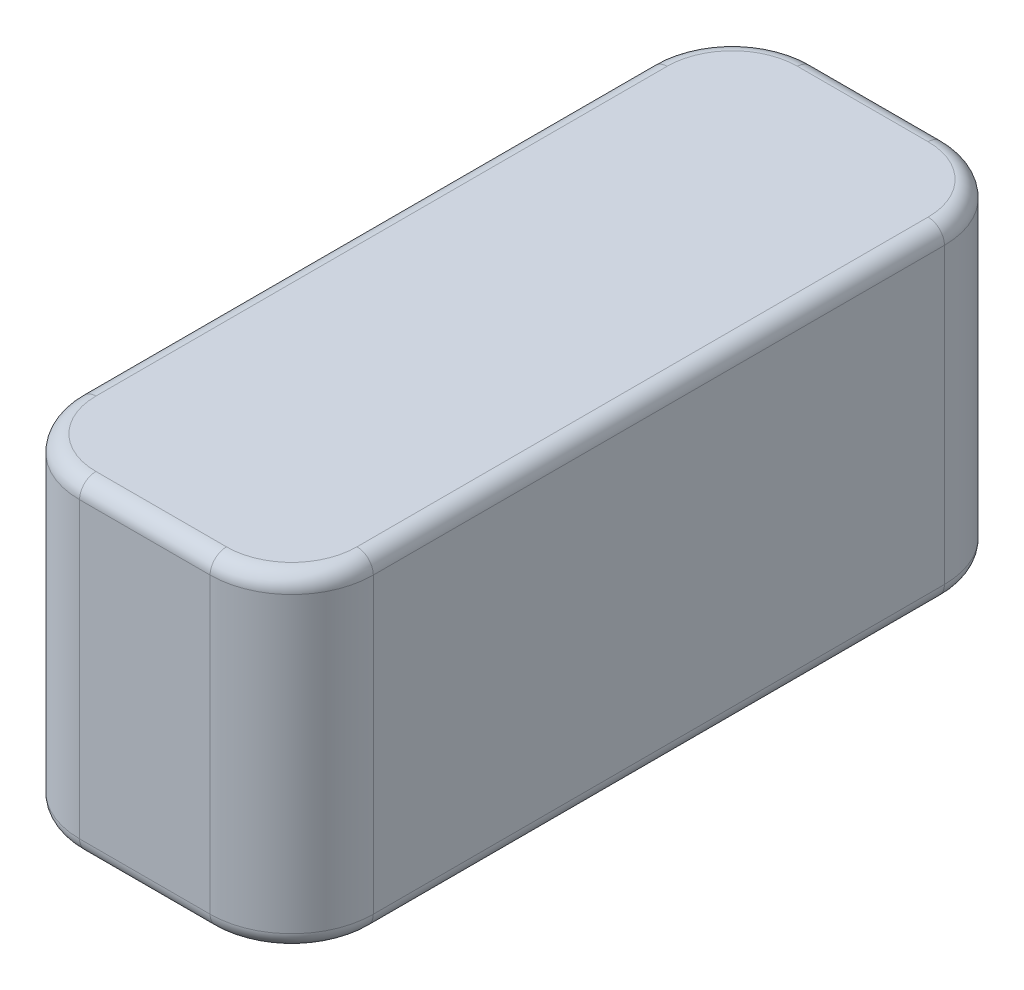
ISO-10303-21;
HEADER;
FILE_DESCRIPTION(('STEP AP214'),'2;1');
FILE_NAME('part.step','',(''),(''),'','','');
FILE_SCHEMA(('AUTOMOTIVE_DESIGN { 1 0 10303 214 1 1 1 1 }'));
ENDSEC;
DATA;
#1=APPLICATION_CONTEXT('core data for automotive mechanical design processes');
#2=APPLICATION_PROTOCOL_DEFINITION('international standard','automotive_design',2000,#1);
#3=PRODUCT_CONTEXT('',#1,'mechanical');
#4=PRODUCT('Part','Part','',(#3));
#5=PRODUCT_RELATED_PRODUCT_CATEGORY('part','',(#4));
#6=PRODUCT_DEFINITION_FORMATION('','',#4);
#7=PRODUCT_DEFINITION_CONTEXT('part definition',#1,'design');
#8=PRODUCT_DEFINITION('design','',#6,#7);
#9=PRODUCT_DEFINITION_SHAPE('','',#8);
#10=(LENGTH_UNIT() NAMED_UNIT(*) SI_UNIT(.MILLI.,.METRE.));
#11=(NAMED_UNIT(*) PLANE_ANGLE_UNIT() SI_UNIT($,.RADIAN.));
#12=(NAMED_UNIT(*) SI_UNIT($,.STERADIAN.) SOLID_ANGLE_UNIT());
#13=UNCERTAINTY_MEASURE_WITH_UNIT(LENGTH_MEASURE(1.E-05),#10,'distance_accuracy_value','');
#14=(GEOMETRIC_REPRESENTATION_CONTEXT(3) GLOBAL_UNCERTAINTY_ASSIGNED_CONTEXT((#13)) GLOBAL_UNIT_ASSIGNED_CONTEXT((#10,
#11,#12)) REPRESENTATION_CONTEXT('',''));
#15=CARTESIAN_POINT('',(0.,0.,0.));
#16=DIRECTION('',(0.,0.,1.));
#17=DIRECTION('',(1.,0.,0.));
#18=AXIS2_PLACEMENT_3D('',#15,#16,#17);
#19=CARTESIAN_POINT('',(-9.,20.,22.5));
#20=DIRECTION('',(1.,0.,0.));
#21=DIRECTION('',(0.,0.,-1.));
#22=AXIS2_PLACEMENT_3D('',#19,#20,#21);
#23=PLANE('',#22);
#24=DIRECTION('',(0.,-1.,0.));
#25=VECTOR('',#24,1.);
#26=CARTESIAN_POINT('',(-9.,20.,-17.5));
#27=LINE('',#26,#25);
#28=CARTESIAN_POINT('',(-9.,19.,-17.5));
#29=VERTEX_POINT('',#28);
#30=CARTESIAN_POINT('',(-9.,1.,-17.5));
#31=VERTEX_POINT('',#30);
#32=EDGE_CURVE('E298',#29,#31,#27,.T.);
#33=ORIENTED_EDGE('',*,*,#32,.T.);
#34=DIRECTION('',(0.,0.,1.));
#35=VECTOR('',#34,1.);
#36=CARTESIAN_POINT('',(-9.,1.,22.5));
#37=LINE('',#36,#35);
#38=CARTESIAN_POINT('',(-9.,1.,17.5));
#39=VERTEX_POINT('',#38);
#40=EDGE_CURVE('E198',#31,#39,#37,.T.);
#41=ORIENTED_EDGE('',*,*,#40,.T.);
#42=DIRECTION('',(0.,-1.,0.));
#43=VECTOR('',#42,1.);
#44=CARTESIAN_POINT('',(-9.,20.,17.5));
#45=LINE('',#44,#43);
#46=CARTESIAN_POINT('',(-9.,19.,17.5));
#47=VERTEX_POINT('',#46);
#48=EDGE_CURVE('E301',#39,#47,#45,.F.);
#49=ORIENTED_EDGE('',*,*,#48,.T.);
#50=DIRECTION('',(0.,0.,1.));
#51=VECTOR('',#50,1.);
#52=CARTESIAN_POINT('',(-9.,19.,-17.5));
#53=LINE('',#52,#51);
#54=EDGE_CURVE('E196',#47,#29,#53,.F.);
#55=ORIENTED_EDGE('',*,*,#54,.T.);
#56=EDGE_LOOP('',(#33,#41,#49,#55));
#57=FACE_BOUND('',#56,.T.);
#58=ADVANCED_FACE('F41',(#57),#23,.F.);
#59=CARTESIAN_POINT('',(9.,20.,22.5));
#60=DIRECTION('',(0.,0.,-1.));
#61=DIRECTION('',(-1.,0.,0.));
#62=AXIS2_PLACEMENT_3D('',#59,#60,#61);
#63=PLANE('',#62);
#64=DIRECTION('',(0.,-1.,0.));
#65=VECTOR('',#64,1.);
#66=CARTESIAN_POINT('',(-4.,20.,22.5));
#67=LINE('',#66,#65);
#68=CARTESIAN_POINT('',(-4.,19.,22.5));
#69=VERTEX_POINT('',#68);
#70=CARTESIAN_POINT('',(-4.,1.,22.5));
#71=VERTEX_POINT('',#70);
#72=EDGE_CURVE('E290',#69,#71,#67,.T.);
#73=ORIENTED_EDGE('',*,*,#72,.T.);
#74=DIRECTION('',(1.,0.,0.));
#75=VECTOR('',#74,1.);
#76=CARTESIAN_POINT('',(9.,1.,22.5));
#77=LINE('',#76,#75);
#78=CARTESIAN_POINT('',(4.,1.,22.5));
#79=VERTEX_POINT('',#78);
#80=EDGE_CURVE('E207',#71,#79,#77,.T.);
#81=ORIENTED_EDGE('',*,*,#80,.T.);
#82=DIRECTION('',(0.,-1.,0.));
#83=VECTOR('',#82,1.);
#84=CARTESIAN_POINT('',(4.,20.,22.5));
#85=LINE('',#84,#83);
#86=CARTESIAN_POINT('',(4.,19.,22.5));
#87=VERTEX_POINT('',#86);
#88=EDGE_CURVE('E295',#79,#87,#85,.F.);
#89=ORIENTED_EDGE('',*,*,#88,.T.);
#90=DIRECTION('',(1.,0.,0.));
#91=VECTOR('',#90,1.);
#92=CARTESIAN_POINT('',(-4.,19.,22.5));
#93=LINE('',#92,#91);
#94=EDGE_CURVE('E205',#87,#69,#93,.F.);
#95=ORIENTED_EDGE('',*,*,#94,.T.);
#96=EDGE_LOOP('',(#73,#81,#89,#95));
#97=FACE_BOUND('',#96,.T.);
#98=ADVANCED_FACE('F354',(#97),#63,.F.);
#99=CARTESIAN_POINT('',(9.,20.,22.5));
#100=DIRECTION('',(-1.,0.,0.));
#101=DIRECTION('',(0.,0.,1.));
#102=AXIS2_PLACEMENT_3D('',#99,#100,#101);
#103=PLANE('',#102);
#104=DIRECTION('',(0.,-1.,0.));
#105=VECTOR('',#104,1.);
#106=CARTESIAN_POINT('',(9.,20.,17.5));
#107=LINE('',#106,#105);
#108=CARTESIAN_POINT('',(9.,19.,17.5));
#109=VERTEX_POINT('',#108);
#110=CARTESIAN_POINT('',(9.,1.,17.5));
#111=VERTEX_POINT('',#110);
#112=EDGE_CURVE('E288',#109,#111,#107,.T.);
#113=ORIENTED_EDGE('',*,*,#112,.T.);
#114=DIRECTION('',(0.,0.,-1.));
#115=VECTOR('',#114,1.);
#116=CARTESIAN_POINT('',(9.,1.,22.5));
#117=LINE('',#116,#115);
#118=CARTESIAN_POINT('',(9.,1.,-17.5));
#119=VERTEX_POINT('',#118);
#120=EDGE_CURVE('E215',#111,#119,#117,.T.);
#121=ORIENTED_EDGE('',*,*,#120,.T.);
#122=DIRECTION('',(0.,-1.,0.));
#123=VECTOR('',#122,1.);
#124=CARTESIAN_POINT('',(9.,20.,-17.5));
#125=LINE('',#124,#123);
#126=CARTESIAN_POINT('',(9.,19.,-17.5));
#127=VERTEX_POINT('',#126);
#128=EDGE_CURVE('E246',#119,#127,#125,.F.);
#129=ORIENTED_EDGE('',*,*,#128,.T.);
#130=DIRECTION('',(0.,0.,-1.));
#131=VECTOR('',#130,1.);
#132=CARTESIAN_POINT('',(9.,19.,17.5));
#133=LINE('',#132,#131);
#134=EDGE_CURVE('E213',#127,#109,#133,.F.);
#135=ORIENTED_EDGE('',*,*,#134,.T.);
#136=EDGE_LOOP('',(#113,#121,#129,#135));
#137=FACE_BOUND('',#136,.T.);
#138=ADVANCED_FACE('F286',(#137),#103,.F.);
#139=CARTESIAN_POINT('',(9.,20.,-22.5));
#140=DIRECTION('',(0.,0.,1.));
#141=DIRECTION('',(1.,0.,0.));
#142=AXIS2_PLACEMENT_3D('',#139,#140,#141);
#143=PLANE('',#142);
#144=DIRECTION('',(0.,-1.,0.));
#145=VECTOR('',#144,1.);
#146=CARTESIAN_POINT('',(4.,20.,-22.5));
#147=LINE('',#146,#145);
#148=CARTESIAN_POINT('',(4.,19.,-22.5));
#149=VERTEX_POINT('',#148);
#150=CARTESIAN_POINT('',(4.,1.,-22.5));
#151=VERTEX_POINT('',#150);
#152=EDGE_CURVE('E174',#149,#151,#147,.T.);
#153=ORIENTED_EDGE('',*,*,#152,.T.);
#154=DIRECTION('',(-1.,0.,0.));
#155=VECTOR('',#154,1.);
#156=CARTESIAN_POINT('',(9.,1.,-22.5));
#157=LINE('',#156,#155);
#158=CARTESIAN_POINT('',(-4.,1.,-22.5));
#159=VERTEX_POINT('',#158);
#160=EDGE_CURVE('E190',#151,#159,#157,.T.);
#161=ORIENTED_EDGE('',*,*,#160,.T.);
#162=DIRECTION('',(0.,-1.,0.));
#163=VECTOR('',#162,1.);
#164=CARTESIAN_POINT('',(-4.,20.,-22.5));
#165=LINE('',#164,#163);
#166=CARTESIAN_POINT('',(-4.,19.,-22.5));
#167=VERTEX_POINT('',#166);
#168=EDGE_CURVE('E304',#159,#167,#165,.F.);
#169=ORIENTED_EDGE('',*,*,#168,.T.);
#170=DIRECTION('',(-1.,0.,0.));
#171=VECTOR('',#170,1.);
#172=CARTESIAN_POINT('',(4.,19.,-22.5));
#173=LINE('',#172,#171);
#174=EDGE_CURVE('E188',#167,#149,#173,.F.);
#175=ORIENTED_EDGE('',*,*,#174,.T.);
#176=EDGE_LOOP('',(#153,#161,#169,#175));
#177=FACE_BOUND('',#176,.T.);
#178=ADVANCED_FACE('F326',(#177),#143,.F.);
#179=CARTESIAN_POINT('',(0.,20.,0.));
#180=DIRECTION('',(0.,1.,0.));
#181=DIRECTION('',(0.,0.,1.));
#182=AXIS2_PLACEMENT_3D('',#179,#180,#181);
#183=PLANE('',#182);
#184=DIRECTION('',(0.,0.,1.));
#185=VECTOR('',#184,1.);
#186=CARTESIAN_POINT('',(-8.,20.,17.5));
#187=LINE('',#186,#185);
#188=CARTESIAN_POINT('',(-8.,20.,-17.5));
#189=VERTEX_POINT('',#188);
#190=CARTESIAN_POINT('',(-8.,20.,17.5));
#191=VERTEX_POINT('',#190);
#192=EDGE_CURVE('E50',#189,#191,#187,.T.);
#193=ORIENTED_EDGE('',*,*,#192,.T.);
#194=CARTESIAN_POINT('',(-4.,20.,17.5));
#195=DIRECTION('',(0.,1.,0.));
#196=DIRECTION('',(0.,0.,1.));
#197=AXIS2_PLACEMENT_3D('',#194,#195,#196);
#198=CIRCLE('',#197,4.);
#199=CARTESIAN_POINT('',(-4.,20.,21.5));
#200=VERTEX_POINT('',#199);
#201=EDGE_CURVE('E11',#191,#200,#198,.T.);
#202=ORIENTED_EDGE('',*,*,#201,.T.);
#203=DIRECTION('',(1.,0.,0.));
#204=VECTOR('',#203,1.);
#205=CARTESIAN_POINT('',(4.,20.,21.5));
#206=LINE('',#205,#204);
#207=CARTESIAN_POINT('',(4.,20.,21.5));
#208=VERTEX_POINT('',#207);
#209=EDGE_CURVE('E217',#200,#208,#206,.T.);
#210=ORIENTED_EDGE('',*,*,#209,.T.);
#211=CARTESIAN_POINT('',(4.,20.,17.5));
#212=DIRECTION('',(0.,1.,0.));
#213=DIRECTION('',(0.,0.,1.));
#214=AXIS2_PLACEMENT_3D('',#211,#212,#213);
#215=CIRCLE('',#214,4.);
#216=CARTESIAN_POINT('',(8.,20.,17.5));
#217=VERTEX_POINT('',#216);
#218=EDGE_CURVE('E219',#208,#217,#215,.T.);
#219=ORIENTED_EDGE('',*,*,#218,.T.);
#220=DIRECTION('',(0.,0.,-1.));
#221=VECTOR('',#220,1.);
#222=CARTESIAN_POINT('',(8.,20.,-17.5));
#223=LINE('',#222,#221);
#224=CARTESIAN_POINT('',(8.,20.,-17.5));
#225=VERTEX_POINT('',#224);
#226=EDGE_CURVE('E221',#217,#225,#223,.T.);
#227=ORIENTED_EDGE('',*,*,#226,.T.);
#228=CARTESIAN_POINT('',(4.,20.,-17.5));
#229=DIRECTION('',(0.,1.,0.));
#230=DIRECTION('',(0.,0.,1.));
#231=AXIS2_PLACEMENT_3D('',#228,#229,#230);
#232=CIRCLE('',#231,4.);
#233=CARTESIAN_POINT('',(4.,20.,-21.5));
#234=VERTEX_POINT('',#233);
#235=EDGE_CURVE('E223',#225,#234,#232,.T.);
#236=ORIENTED_EDGE('',*,*,#235,.T.);
#237=DIRECTION('',(-1.,0.,0.));
#238=VECTOR('',#237,1.);
#239=CARTESIAN_POINT('',(-4.,20.,-21.5));
#240=LINE('',#239,#238);
#241=CARTESIAN_POINT('',(-4.,20.,-21.5));
#242=VERTEX_POINT('',#241);
#243=EDGE_CURVE('E225',#234,#242,#240,.T.);
#244=ORIENTED_EDGE('',*,*,#243,.T.);
#245=CARTESIAN_POINT('',(-4.,20.,-17.5));
#246=DIRECTION('',(0.,1.,0.));
#247=DIRECTION('',(0.,0.,1.));
#248=AXIS2_PLACEMENT_3D('',#245,#246,#247);
#249=CIRCLE('',#248,4.);
#250=EDGE_CURVE('E61',#242,#189,#249,.T.);
#251=ORIENTED_EDGE('',*,*,#250,.T.);
#252=EDGE_LOOP('',(#193,#202,#210,#219,#227,#236,#244,#251));
#253=FACE_BOUND('',#252,.T.);
#254=ADVANCED_FACE('F342',(#253),#183,.T.);
#255=CARTESIAN_POINT('',(0.,0.,0.));
#256=DIRECTION('',(0.,1.,0.));
#257=DIRECTION('',(0.,0.,1.));
#258=AXIS2_PLACEMENT_3D('',#255,#256,#257);
#259=PLANE('',#258);
#260=DIRECTION('',(-1.,0.,0.));
#261=VECTOR('',#260,1.);
#262=CARTESIAN_POINT('',(0.,0.,-21.5));
#263=LINE('',#262,#261);
#264=CARTESIAN_POINT('',(-4.,0.,-21.5));
#265=VERTEX_POINT('',#264);
#266=CARTESIAN_POINT('',(4.,0.,-21.5));
#267=VERTEX_POINT('',#266);
#268=EDGE_CURVE('E178',#265,#267,#263,.F.);
#269=ORIENTED_EDGE('',*,*,#268,.T.);
#270=CARTESIAN_POINT('',(4.,0.,-17.5));
#271=DIRECTION('',(0.,1.,0.));
#272=DIRECTION('',(0.,0.,1.));
#273=AXIS2_PLACEMENT_3D('',#270,#271,#272);
#274=CIRCLE('',#273,4.);
#275=CARTESIAN_POINT('',(8.,0.,-17.5));
#276=VERTEX_POINT('',#275);
#277=EDGE_CURVE('E159',#267,#276,#274,.F.);
#278=ORIENTED_EDGE('',*,*,#277,.T.);
#279=DIRECTION('',(0.,0.,-1.));
#280=VECTOR('',#279,1.);
#281=CARTESIAN_POINT('',(8.,0.,0.));
#282=LINE('',#281,#280);
#283=CARTESIAN_POINT('',(8.,0.,17.5));
#284=VERTEX_POINT('',#283);
#285=EDGE_CURVE('E167',#276,#284,#282,.F.);
#286=ORIENTED_EDGE('',*,*,#285,.T.);
#287=CARTESIAN_POINT('',(4.,0.,17.5));
#288=DIRECTION('',(0.,1.,0.));
#289=DIRECTION('',(0.,0.,1.));
#290=AXIS2_PLACEMENT_3D('',#287,#288,#289);
#291=CIRCLE('',#290,4.);
#292=CARTESIAN_POINT('',(4.,0.,21.5));
#293=VERTEX_POINT('',#292);
#294=EDGE_CURVE('E173',#284,#293,#291,.F.);
#295=ORIENTED_EDGE('',*,*,#294,.T.);
#296=DIRECTION('',(1.,0.,0.));
#297=VECTOR('',#296,1.);
#298=CARTESIAN_POINT('',(0.,0.,21.5));
#299=LINE('',#298,#297);
#300=CARTESIAN_POINT('',(-4.,0.,21.5));
#301=VERTEX_POINT('',#300);
#302=EDGE_CURVE('E309',#293,#301,#299,.F.);
#303=ORIENTED_EDGE('',*,*,#302,.T.);
#304=CARTESIAN_POINT('',(-4.,0.,17.5));
#305=DIRECTION('',(0.,1.,0.));
#306=DIRECTION('',(0.,0.,1.));
#307=AXIS2_PLACEMENT_3D('',#304,#305,#306);
#308=CIRCLE('',#307,4.);
#309=CARTESIAN_POINT('',(-8.,0.,17.5));
#310=VERTEX_POINT('',#309);
#311=EDGE_CURVE('E311',#301,#310,#308,.F.);
#312=ORIENTED_EDGE('',*,*,#311,.T.);
#313=DIRECTION('',(0.,0.,1.));
#314=VECTOR('',#313,1.);
#315=CARTESIAN_POINT('',(-8.,0.,0.));
#316=LINE('',#315,#314);
#317=CARTESIAN_POINT('',(-8.,0.,-17.5));
#318=VERTEX_POINT('',#317);
#319=EDGE_CURVE('E313',#310,#318,#316,.F.);
#320=ORIENTED_EDGE('',*,*,#319,.T.);
#321=CARTESIAN_POINT('',(-4.,0.,-17.5));
#322=DIRECTION('',(0.,1.,0.));
#323=DIRECTION('',(0.,0.,1.));
#324=AXIS2_PLACEMENT_3D('',#321,#322,#323);
#325=CIRCLE('',#324,4.);
#326=EDGE_CURVE('E183',#318,#265,#325,.F.);
#327=ORIENTED_EDGE('',*,*,#326,.T.);
#328=EDGE_LOOP('',(#269,#278,#286,#295,#303,#312,#320,#327));
#329=FACE_BOUND('',#328,.T.);
#330=ADVANCED_FACE('F176',(#329),#259,.F.);
#331=CARTESIAN_POINT('',(4.,20.,17.5));
#332=DIRECTION('',(0.,-1.,0.));
#333=DIRECTION('',(0.,0.,-1.));
#334=AXIS2_PLACEMENT_3D('',#331,#332,#333);
#335=CYLINDRICAL_SURFACE('',#334,5.);
#336=ORIENTED_EDGE('',*,*,#88,.F.);
#337=CARTESIAN_POINT('',(4.,1.,17.5));
#338=DIRECTION('',(0.,1.,0.));
#339=DIRECTION('',(0.,0.,1.));
#340=AXIS2_PLACEMENT_3D('',#337,#338,#339);
#341=CIRCLE('',#340,5.);
#342=EDGE_CURVE('E211',#79,#111,#341,.T.);
#343=ORIENTED_EDGE('',*,*,#342,.T.);
#344=ORIENTED_EDGE('',*,*,#112,.F.);
#345=CARTESIAN_POINT('',(4.,19.,17.5));
#346=DIRECTION('',(0.,1.,0.));
#347=DIRECTION('',(0.,0.,1.));
#348=AXIS2_PLACEMENT_3D('',#345,#346,#347);
#349=CIRCLE('',#348,5.);
#350=EDGE_CURVE('E209',#109,#87,#349,.F.);
#351=ORIENTED_EDGE('',*,*,#350,.T.);
#352=EDGE_LOOP('',(#336,#343,#344,#351));
#353=FACE_BOUND('',#352,.T.);
#354=ADVANCED_FACE('F378',(#353),#335,.T.);
#355=CARTESIAN_POINT('',(-4.,20.,17.5));
#356=DIRECTION('',(0.,-1.,0.));
#357=DIRECTION('',(0.,0.,-1.));
#358=AXIS2_PLACEMENT_3D('',#355,#356,#357);
#359=CYLINDRICAL_SURFACE('',#358,5.);
#360=ORIENTED_EDGE('',*,*,#48,.F.);
#361=CARTESIAN_POINT('',(-4.,1.,17.5));
#362=DIRECTION('',(0.,1.,0.));
#363=DIRECTION('',(0.,0.,1.));
#364=AXIS2_PLACEMENT_3D('',#361,#362,#363);
#365=CIRCLE('',#364,5.);
#366=EDGE_CURVE('E203',#39,#71,#365,.T.);
#367=ORIENTED_EDGE('',*,*,#366,.T.);
#368=ORIENTED_EDGE('',*,*,#72,.F.);
#369=CARTESIAN_POINT('',(-4.,19.,17.5));
#370=DIRECTION('',(0.,1.,0.));
#371=DIRECTION('',(0.,0.,1.));
#372=AXIS2_PLACEMENT_3D('',#369,#370,#371);
#373=CIRCLE('',#372,5.);
#374=EDGE_CURVE('E200',#69,#47,#373,.F.);
#375=ORIENTED_EDGE('',*,*,#374,.T.);
#376=EDGE_LOOP('',(#360,#367,#368,#375));
#377=FACE_BOUND('',#376,.T.);
#378=ADVANCED_FACE('F359',(#377),#359,.T.);
#379=CARTESIAN_POINT('',(4.,20.,-17.5));
#380=DIRECTION('',(0.,-1.,0.));
#381=DIRECTION('',(0.,0.,-1.));
#382=AXIS2_PLACEMENT_3D('',#379,#380,#381);
#383=CYLINDRICAL_SURFACE('',#382,5.);
#384=ORIENTED_EDGE('',*,*,#128,.F.);
#385=CARTESIAN_POINT('',(4.,1.,-17.5));
#386=DIRECTION('',(0.,1.,0.));
#387=DIRECTION('',(0.,0.,1.));
#388=AXIS2_PLACEMENT_3D('',#385,#386,#387);
#389=CIRCLE('',#388,5.);
#390=EDGE_CURVE('E161',#119,#151,#389,.T.);
#391=ORIENTED_EDGE('',*,*,#390,.T.);
#392=ORIENTED_EDGE('',*,*,#152,.F.);
#393=CARTESIAN_POINT('',(4.,19.,-17.5));
#394=DIRECTION('',(0.,1.,0.));
#395=DIRECTION('',(0.,0.,1.));
#396=AXIS2_PLACEMENT_3D('',#393,#394,#395);
#397=CIRCLE('',#396,5.);
#398=EDGE_CURVE('E180',#149,#127,#397,.F.);
#399=ORIENTED_EDGE('',*,*,#398,.T.);
#400=EDGE_LOOP('',(#384,#391,#392,#399));
#401=FACE_BOUND('',#400,.T.);
#402=ADVANCED_FACE('F282',(#401),#383,.T.);
#403=CARTESIAN_POINT('',(-4.,20.,-17.5));
#404=DIRECTION('',(0.,-1.,0.));
#405=DIRECTION('',(0.,0.,-1.));
#406=AXIS2_PLACEMENT_3D('',#403,#404,#405);
#407=CYLINDRICAL_SURFACE('',#406,5.);
#408=ORIENTED_EDGE('',*,*,#168,.F.);
#409=CARTESIAN_POINT('',(-4.,1.,-17.5));
#410=DIRECTION('',(0.,1.,0.));
#411=DIRECTION('',(0.,0.,1.));
#412=AXIS2_PLACEMENT_3D('',#409,#410,#411);
#413=CIRCLE('',#412,5.);
#414=EDGE_CURVE('E194',#159,#31,#413,.T.);
#415=ORIENTED_EDGE('',*,*,#414,.T.);
#416=ORIENTED_EDGE('',*,*,#32,.F.);
#417=CARTESIAN_POINT('',(-4.,19.,-17.5));
#418=DIRECTION('',(0.,1.,0.));
#419=DIRECTION('',(0.,0.,1.));
#420=AXIS2_PLACEMENT_3D('',#417,#418,#419);
#421=CIRCLE('',#420,5.);
#422=EDGE_CURVE('E192',#29,#167,#421,.F.);
#423=ORIENTED_EDGE('',*,*,#422,.T.);
#424=EDGE_LOOP('',(#408,#415,#416,#423));
#425=FACE_BOUND('',#424,.T.);
#426=ADVANCED_FACE('F328',(#425),#407,.T.);
#427=CARTESIAN_POINT('',(-4.,1.,17.5));
#428=DIRECTION('',(0.,1.,0.));
#429=DIRECTION('',(0.,0.,1.));
#430=AXIS2_PLACEMENT_3D('',#427,#428,#429);
#431=TOROIDAL_SURFACE('',#430,4.,1.);
#432=CARTESIAN_POINT('',(-4.,1.,21.5));
#433=DIRECTION('',(1.,0.,0.));
#434=DIRECTION('',(0.,0.,-1.));
#435=AXIS2_PLACEMENT_3D('',#432,#433,#434);
#436=CIRCLE('',#435,1.);
#437=EDGE_CURVE('E240',#71,#301,#436,.T.);
#438=ORIENTED_EDGE('',*,*,#437,.F.);
#439=ORIENTED_EDGE('',*,*,#366,.F.);
#440=CARTESIAN_POINT('',(-8.,1.,17.5));
#441=DIRECTION('',(0.,0.,-1.));
#442=DIRECTION('',(-1.,0.,0.));
#443=AXIS2_PLACEMENT_3D('',#440,#441,#442);
#444=CIRCLE('',#443,1.);
#445=EDGE_CURVE('E243',#310,#39,#444,.T.);
#446=ORIENTED_EDGE('',*,*,#445,.F.);
#447=ORIENTED_EDGE('',*,*,#311,.F.);
#448=EDGE_LOOP('',(#438,#439,#446,#447));
#449=FACE_BOUND('',#448,.T.);
#450=ADVANCED_FACE('F363',(#449),#431,.T.);
#451=CARTESIAN_POINT('',(-8.,1.,22.5));
#452=DIRECTION('',(0.,0.,1.));
#453=DIRECTION('',(1.,0.,0.));
#454=AXIS2_PLACEMENT_3D('',#451,#452,#453);
#455=CYLINDRICAL_SURFACE('',#454,1.);
#456=ORIENTED_EDGE('',*,*,#445,.T.);
#457=ORIENTED_EDGE('',*,*,#40,.F.);
#458=CARTESIAN_POINT('',(-8.,1.,-17.5));
#459=DIRECTION('',(0.,0.,-1.));
#460=DIRECTION('',(-1.,0.,0.));
#461=AXIS2_PLACEMENT_3D('',#458,#459,#460);
#462=CIRCLE('',#461,1.);
#463=EDGE_CURVE('E237',#318,#31,#462,.T.);
#464=ORIENTED_EDGE('',*,*,#463,.F.);
#465=ORIENTED_EDGE('',*,*,#319,.F.);
#466=EDGE_LOOP('',(#456,#457,#464,#465));
#467=FACE_BOUND('',#466,.T.);
#468=ADVANCED_FACE('F368',(#467),#455,.T.);
#469=CARTESIAN_POINT('',(9.,1.,21.5));
#470=DIRECTION('',(1.,0.,0.));
#471=DIRECTION('',(0.,0.,-1.));
#472=AXIS2_PLACEMENT_3D('',#469,#470,#471);
#473=CYLINDRICAL_SURFACE('',#472,1.);
#474=ORIENTED_EDGE('',*,*,#437,.T.);
#475=ORIENTED_EDGE('',*,*,#302,.F.);
#476=CARTESIAN_POINT('',(4.,1.,21.5));
#477=DIRECTION('',(1.,0.,0.));
#478=DIRECTION('',(0.,0.,-1.));
#479=AXIS2_PLACEMENT_3D('',#476,#477,#478);
#480=CIRCLE('',#479,1.);
#481=EDGE_CURVE('E234',#79,#293,#480,.T.);
#482=ORIENTED_EDGE('',*,*,#481,.F.);
#483=ORIENTED_EDGE('',*,*,#80,.F.);
#484=EDGE_LOOP('',(#474,#475,#482,#483));
#485=FACE_BOUND('',#484,.T.);
#486=ADVANCED_FACE('F400',(#485),#473,.T.);
#487=CARTESIAN_POINT('',(-4.,1.,-17.5));
#488=DIRECTION('',(0.,1.,0.));
#489=DIRECTION('',(0.,0.,1.));
#490=AXIS2_PLACEMENT_3D('',#487,#488,#489);
#491=TOROIDAL_SURFACE('',#490,4.,1.);
#492=ORIENTED_EDGE('',*,*,#463,.T.);
#493=ORIENTED_EDGE('',*,*,#414,.F.);
#494=CARTESIAN_POINT('',(-4.,1.,-21.5));
#495=DIRECTION('',(1.,0.,0.));
#496=DIRECTION('',(0.,0.,-1.));
#497=AXIS2_PLACEMENT_3D('',#494,#495,#496);
#498=CIRCLE('',#497,1.);
#499=EDGE_CURVE('E231',#265,#159,#498,.T.);
#500=ORIENTED_EDGE('',*,*,#499,.F.);
#501=ORIENTED_EDGE('',*,*,#326,.F.);
#502=EDGE_LOOP('',(#492,#493,#500,#501));
#503=FACE_BOUND('',#502,.T.);
#504=ADVANCED_FACE('F320',(#503),#491,.T.);
#505=CARTESIAN_POINT('',(4.,1.,17.5));
#506=DIRECTION('',(0.,1.,0.));
#507=DIRECTION('',(0.,0.,1.));
#508=AXIS2_PLACEMENT_3D('',#505,#506,#507);
#509=TOROIDAL_SURFACE('',#508,4.,1.);
#510=ORIENTED_EDGE('',*,*,#481,.T.);
#511=ORIENTED_EDGE('',*,*,#294,.F.);
#512=CARTESIAN_POINT('',(8.,1.,17.5));
#513=DIRECTION('',(0.,0.,-1.));
#514=DIRECTION('',(-1.,0.,0.));
#515=AXIS2_PLACEMENT_3D('',#512,#513,#514);
#516=CIRCLE('',#515,1.);
#517=EDGE_CURVE('E170',#111,#284,#516,.T.);
#518=ORIENTED_EDGE('',*,*,#517,.F.);
#519=ORIENTED_EDGE('',*,*,#342,.F.);
#520=EDGE_LOOP('',(#510,#511,#518,#519));
#521=FACE_BOUND('',#520,.T.);
#522=ADVANCED_FACE('F394',(#521),#509,.T.);
#523=CARTESIAN_POINT('',(9.,1.,-21.5));
#524=DIRECTION('',(-1.,0.,0.));
#525=DIRECTION('',(0.,0.,1.));
#526=AXIS2_PLACEMENT_3D('',#523,#524,#525);
#527=CYLINDRICAL_SURFACE('',#526,1.);
#528=ORIENTED_EDGE('',*,*,#499,.T.);
#529=ORIENTED_EDGE('',*,*,#160,.F.);
#530=CARTESIAN_POINT('',(4.,1.,-21.5));
#531=DIRECTION('',(1.,0.,0.));
#532=DIRECTION('',(0.,0.,-1.));
#533=AXIS2_PLACEMENT_3D('',#530,#531,#532);
#534=CIRCLE('',#533,1.);
#535=EDGE_CURVE('E164',#267,#151,#534,.T.);
#536=ORIENTED_EDGE('',*,*,#535,.F.);
#537=ORIENTED_EDGE('',*,*,#268,.F.);
#538=EDGE_LOOP('',(#528,#529,#536,#537));
#539=FACE_BOUND('',#538,.T.);
#540=ADVANCED_FACE('F323',(#539),#527,.T.);
#541=CARTESIAN_POINT('',(8.,1.,22.5));
#542=DIRECTION('',(0.,0.,-1.));
#543=DIRECTION('',(-1.,0.,0.));
#544=AXIS2_PLACEMENT_3D('',#541,#542,#543);
#545=CYLINDRICAL_SURFACE('',#544,1.);
#546=ORIENTED_EDGE('',*,*,#517,.T.);
#547=ORIENTED_EDGE('',*,*,#285,.F.);
#548=CARTESIAN_POINT('',(8.,1.,-17.5));
#549=DIRECTION('',(0.,0.,-1.));
#550=DIRECTION('',(-1.,0.,0.));
#551=AXIS2_PLACEMENT_3D('',#548,#549,#550);
#552=CIRCLE('',#551,1.);
#553=EDGE_CURVE('E155',#119,#276,#552,.T.);
#554=ORIENTED_EDGE('',*,*,#553,.F.);
#555=ORIENTED_EDGE('',*,*,#120,.F.);
#556=EDGE_LOOP('',(#546,#547,#554,#555));
#557=FACE_BOUND('',#556,.T.);
#558=ADVANCED_FACE('F168',(#557),#545,.T.);
#559=CARTESIAN_POINT('',(4.,1.,-17.5));
#560=DIRECTION('',(0.,1.,0.));
#561=DIRECTION('',(0.,0.,1.));
#562=AXIS2_PLACEMENT_3D('',#559,#560,#561);
#563=TOROIDAL_SURFACE('',#562,4.,1.);
#564=ORIENTED_EDGE('',*,*,#535,.T.);
#565=ORIENTED_EDGE('',*,*,#390,.F.);
#566=ORIENTED_EDGE('',*,*,#553,.T.);
#567=ORIENTED_EDGE('',*,*,#277,.F.);
#568=EDGE_LOOP('',(#564,#565,#566,#567));
#569=FACE_BOUND('',#568,.T.);
#570=ADVANCED_FACE('F157',(#569),#563,.T.);
#571=CARTESIAN_POINT('',(4.,19.,-17.5));
#572=DIRECTION('',(0.,1.,0.));
#573=DIRECTION('',(0.,0.,1.));
#574=AXIS2_PLACEMENT_3D('',#571,#572,#573);
#575=TOROIDAL_SURFACE('',#574,4.,1.);
#576=CARTESIAN_POINT('',(8.,19.,-17.5));
#577=DIRECTION('',(0.,0.,1.));
#578=DIRECTION('',(1.,0.,0.));
#579=AXIS2_PLACEMENT_3D('',#576,#577,#578);
#580=CIRCLE('',#579,1.);
#581=EDGE_CURVE('E262',#127,#225,#580,.T.);
#582=ORIENTED_EDGE('',*,*,#581,.F.);
#583=ORIENTED_EDGE('',*,*,#398,.F.);
#584=CARTESIAN_POINT('',(4.,19.,-21.5));
#585=DIRECTION('',(-1.,0.,0.));
#586=DIRECTION('',(0.,0.,1.));
#587=AXIS2_PLACEMENT_3D('',#584,#585,#586);
#588=CIRCLE('',#587,1.);
#589=EDGE_CURVE('E45',#234,#149,#588,.T.);
#590=ORIENTED_EDGE('',*,*,#589,.F.);
#591=ORIENTED_EDGE('',*,*,#235,.F.);
#592=EDGE_LOOP('',(#582,#583,#590,#591));
#593=FACE_BOUND('',#592,.T.);
#594=ADVANCED_FACE('F43',(#593),#575,.T.);
#595=CARTESIAN_POINT('',(0.,19.,-21.5));
#596=DIRECTION('',(1.,0.,0.));
#597=DIRECTION('',(0.,0.,-1.));
#598=AXIS2_PLACEMENT_3D('',#595,#596,#597);
#599=CYLINDRICAL_SURFACE('',#598,1.);
#600=ORIENTED_EDGE('',*,*,#589,.T.);
#601=ORIENTED_EDGE('',*,*,#174,.F.);
#602=CARTESIAN_POINT('',(-4.,19.,-21.5));
#603=DIRECTION('',(-1.,0.,0.));
#604=DIRECTION('',(0.,0.,1.));
#605=AXIS2_PLACEMENT_3D('',#602,#603,#604);
#606=CIRCLE('',#605,1.);
#607=EDGE_CURVE('E260',#242,#167,#606,.T.);
#608=ORIENTED_EDGE('',*,*,#607,.F.);
#609=ORIENTED_EDGE('',*,*,#243,.F.);
#610=EDGE_LOOP('',(#600,#601,#608,#609));
#611=FACE_BOUND('',#610,.T.);
#612=ADVANCED_FACE('F273',(#611),#599,.T.);
#613=CARTESIAN_POINT('',(8.,19.,0.));
#614=DIRECTION('',(0.,0.,1.));
#615=DIRECTION('',(1.,0.,0.));
#616=AXIS2_PLACEMENT_3D('',#613,#614,#615);
#617=CYLINDRICAL_SURFACE('',#616,1.);
#618=ORIENTED_EDGE('',*,*,#581,.T.);
#619=ORIENTED_EDGE('',*,*,#226,.F.);
#620=CARTESIAN_POINT('',(8.,19.,17.5));
#621=DIRECTION('',(0.,0.,1.));
#622=DIRECTION('',(1.,0.,0.));
#623=AXIS2_PLACEMENT_3D('',#620,#621,#622);
#624=CIRCLE('',#623,1.);
#625=EDGE_CURVE('E257',#109,#217,#624,.T.);
#626=ORIENTED_EDGE('',*,*,#625,.F.);
#627=ORIENTED_EDGE('',*,*,#134,.F.);
#628=EDGE_LOOP('',(#618,#619,#626,#627));
#629=FACE_BOUND('',#628,.T.);
#630=ADVANCED_FACE('F418',(#629),#617,.T.);
#631=CARTESIAN_POINT('',(-4.,19.,-17.5));
#632=DIRECTION('',(0.,1.,0.));
#633=DIRECTION('',(0.,0.,1.));
#634=AXIS2_PLACEMENT_3D('',#631,#632,#633);
#635=TOROIDAL_SURFACE('',#634,4.,1.);
#636=ORIENTED_EDGE('',*,*,#607,.T.);
#637=ORIENTED_EDGE('',*,*,#422,.F.);
#638=CARTESIAN_POINT('',(-8.,19.,-17.5));
#639=DIRECTION('',(0.,0.,1.));
#640=DIRECTION('',(1.,0.,0.));
#641=AXIS2_PLACEMENT_3D('',#638,#639,#640);
#642=CIRCLE('',#641,1.);
#643=EDGE_CURVE('E254',#189,#29,#642,.T.);
#644=ORIENTED_EDGE('',*,*,#643,.F.);
#645=ORIENTED_EDGE('',*,*,#250,.F.);
#646=EDGE_LOOP('',(#636,#637,#644,#645));
#647=FACE_BOUND('',#646,.T.);
#648=ADVANCED_FACE('F332',(#647),#635,.T.);
#649=CARTESIAN_POINT('',(4.,19.,17.5));
#650=DIRECTION('',(0.,1.,0.));
#651=DIRECTION('',(0.,0.,1.));
#652=AXIS2_PLACEMENT_3D('',#649,#650,#651);
#653=TOROIDAL_SURFACE('',#652,4.,1.);
#654=ORIENTED_EDGE('',*,*,#625,.T.);
#655=ORIENTED_EDGE('',*,*,#218,.F.);
#656=CARTESIAN_POINT('',(4.,19.,21.5));
#657=DIRECTION('',(-1.,0.,0.));
#658=DIRECTION('',(0.,0.,1.));
#659=AXIS2_PLACEMENT_3D('',#656,#657,#658);
#660=CIRCLE('',#659,1.);
#661=EDGE_CURVE('E251',#87,#208,#660,.T.);
#662=ORIENTED_EDGE('',*,*,#661,.F.);
#663=ORIENTED_EDGE('',*,*,#350,.F.);
#664=EDGE_LOOP('',(#654,#655,#662,#663));
#665=FACE_BOUND('',#664,.T.);
#666=ADVANCED_FACE('F347',(#665),#653,.T.);
#667=CARTESIAN_POINT('',(-8.,19.,0.));
#668=DIRECTION('',(0.,0.,-1.));
#669=DIRECTION('',(-1.,0.,0.));
#670=AXIS2_PLACEMENT_3D('',#667,#668,#669);
#671=CYLINDRICAL_SURFACE('',#670,1.);
#672=ORIENTED_EDGE('',*,*,#643,.T.);
#673=ORIENTED_EDGE('',*,*,#54,.F.);
#674=CARTESIAN_POINT('',(-8.,19.,17.5));
#675=DIRECTION('',(0.,0.,1.));
#676=DIRECTION('',(1.,0.,0.));
#677=AXIS2_PLACEMENT_3D('',#674,#675,#676);
#678=CIRCLE('',#677,1.);
#679=EDGE_CURVE('E249',#191,#47,#678,.T.);
#680=ORIENTED_EDGE('',*,*,#679,.F.);
#681=ORIENTED_EDGE('',*,*,#192,.F.);
#682=EDGE_LOOP('',(#672,#673,#680,#681));
#683=FACE_BOUND('',#682,.T.);
#684=ADVANCED_FACE('F335',(#683),#671,.T.);
#685=CARTESIAN_POINT('',(0.,19.,21.5));
#686=DIRECTION('',(-1.,0.,0.));
#687=DIRECTION('',(0.,0.,1.));
#688=AXIS2_PLACEMENT_3D('',#685,#686,#687);
#689=CYLINDRICAL_SURFACE('',#688,1.);
#690=ORIENTED_EDGE('',*,*,#661,.T.);
#691=ORIENTED_EDGE('',*,*,#209,.F.);
#692=CARTESIAN_POINT('',(-4.,19.,21.5));
#693=DIRECTION('',(-1.,0.,0.));
#694=DIRECTION('',(0.,0.,1.));
#695=AXIS2_PLACEMENT_3D('',#692,#693,#694);
#696=CIRCLE('',#695,1.);
#697=EDGE_CURVE('E247',#69,#200,#696,.T.);
#698=ORIENTED_EDGE('',*,*,#697,.F.);
#699=ORIENTED_EDGE('',*,*,#94,.F.);
#700=EDGE_LOOP('',(#690,#691,#698,#699));
#701=FACE_BOUND('',#700,.T.);
#702=ADVANCED_FACE('F351',(#701),#689,.T.);
#703=CARTESIAN_POINT('',(-4.,19.,17.5));
#704=DIRECTION('',(0.,1.,0.));
#705=DIRECTION('',(0.,0.,1.));
#706=AXIS2_PLACEMENT_3D('',#703,#704,#705);
#707=TOROIDAL_SURFACE('',#706,4.,1.);
#708=ORIENTED_EDGE('',*,*,#679,.T.);
#709=ORIENTED_EDGE('',*,*,#374,.F.);
#710=ORIENTED_EDGE('',*,*,#697,.T.);
#711=ORIENTED_EDGE('',*,*,#201,.F.);
#712=EDGE_LOOP('',(#708,#709,#710,#711));
#713=FACE_BOUND('',#712,.T.);
#714=ADVANCED_FACE('F339',(#713),#707,.T.);
#715=CLOSED_SHELL('',(#58,#98,#138,#178,#254,#330,#354,#378,#402,#426,#450,#468,#486,#504,#522,
#540,#558,#570,#594,#612,#630,#648,#666,#684,#702,#714));
#716=MANIFOLD_SOLID_BREP('B2',#715);
#717=ADVANCED_BREP_SHAPE_REPRESENTATION('',(#18,#716),#14);
#718=SHAPE_DEFINITION_REPRESENTATION(#9,#717);
ENDSEC;
END-ISO-10303-21;
